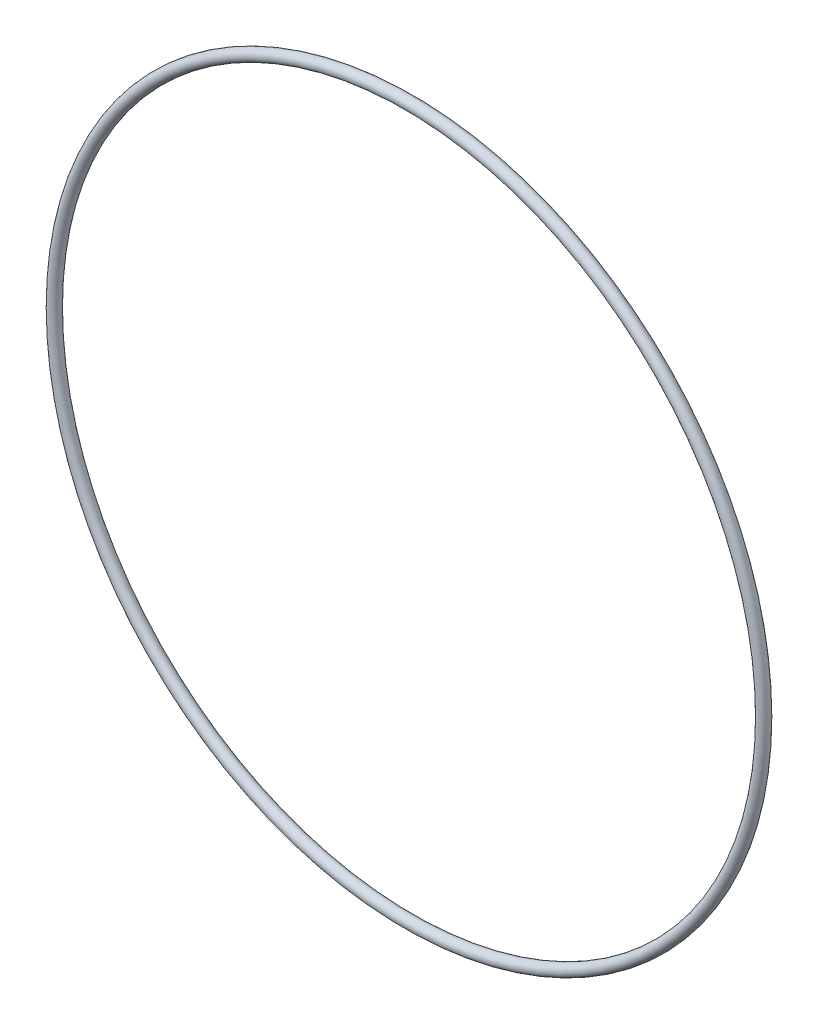
ISO-10303-21;
HEADER;
FILE_DESCRIPTION(('STEP AP214'),'2;1');
FILE_NAME('part.step','',(''),(''),'','','');
FILE_SCHEMA(('AUTOMOTIVE_DESIGN { 1 0 10303 214 1 1 1 1 }'));
ENDSEC;
DATA;
#1=APPLICATION_CONTEXT('core data for automotive mechanical design processes');
#2=APPLICATION_PROTOCOL_DEFINITION('international standard','automotive_design',2000,#1);
#3=PRODUCT_CONTEXT('',#1,'mechanical');
#4=PRODUCT('Part','Part','',(#3));
#5=PRODUCT_RELATED_PRODUCT_CATEGORY('part','',(#4));
#6=PRODUCT_DEFINITION_FORMATION('','',#4);
#7=PRODUCT_DEFINITION_CONTEXT('part definition',#1,'design');
#8=PRODUCT_DEFINITION('design','',#6,#7);
#9=PRODUCT_DEFINITION_SHAPE('','',#8);
#10=(LENGTH_UNIT() NAMED_UNIT(*) SI_UNIT(.MILLI.,.METRE.));
#11=(NAMED_UNIT(*) PLANE_ANGLE_UNIT() SI_UNIT($,.RADIAN.));
#12=(NAMED_UNIT(*) SI_UNIT($,.STERADIAN.) SOLID_ANGLE_UNIT());
#13=UNCERTAINTY_MEASURE_WITH_UNIT(LENGTH_MEASURE(1.E-05),#10,'distance_accuracy_value','');
#14=(GEOMETRIC_REPRESENTATION_CONTEXT(3) GLOBAL_UNCERTAINTY_ASSIGNED_CONTEXT((#13)) GLOBAL_UNIT_ASSIGNED_CONTEXT((#10,
#11,#12)) REPRESENTATION_CONTEXT('',''));
#15=CARTESIAN_POINT('',(0.,0.,0.));
#16=DIRECTION('',(0.,0.,1.));
#17=DIRECTION('',(1.,0.,0.));
#18=AXIS2_PLACEMENT_3D('',#15,#16,#17);
#19=CARTESIAN_POINT('',(0.,0.,0.));
#20=DIRECTION('',(0.,0.,1.));
#21=DIRECTION('',(1.,0.,0.));
#22=AXIS2_PLACEMENT_3D('',#19,#20,#21);
#23=TOROIDAL_SURFACE('',#22,54.7243,0.889000000000003);
#24=CARTESIAN_POINT('',(55.6133,0.,0.));
#25=VERTEX_POINT('',#24);
#26=VERTEX_LOOP('',#25);
#27=FACE_BOUND('',#26,.T.);
#28=ADVANCED_FACE('F30',(#27),#23,.T.);
#29=CLOSED_SHELL('',(#28));
#30=MANIFOLD_SOLID_BREP('B2',#29);
#31=ADVANCED_BREP_SHAPE_REPRESENTATION('',(#18,#30),#14);
#32=SHAPE_DEFINITION_REPRESENTATION(#9,#31);
ENDSEC;
END-ISO-10303-21;
